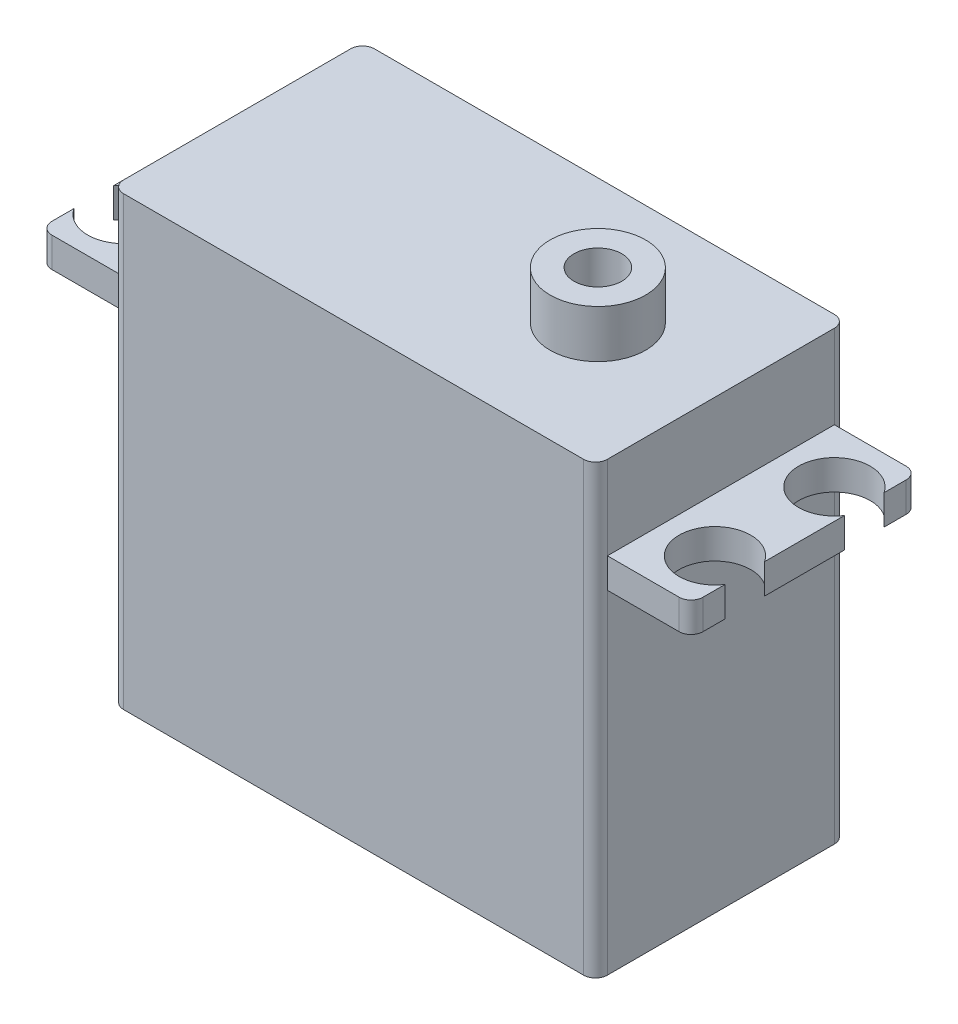
ISO-10303-21;
HEADER;
FILE_DESCRIPTION(('STEP AP214'),'2;1');
FILE_NAME('part.step','',(''),(''),'','','');
FILE_SCHEMA(('AUTOMOTIVE_DESIGN { 1 0 10303 214 1 1 1 1 }'));
ENDSEC;
DATA;
#1=APPLICATION_CONTEXT('core data for automotive mechanical design processes');
#2=APPLICATION_PROTOCOL_DEFINITION('international standard','automotive_design',2000,#1);
#3=PRODUCT_CONTEXT('',#1,'mechanical');
#4=PRODUCT('Part','Part','',(#3));
#5=PRODUCT_RELATED_PRODUCT_CATEGORY('part','',(#4));
#6=PRODUCT_DEFINITION_FORMATION('','',#4);
#7=PRODUCT_DEFINITION_CONTEXT('part definition',#1,'design');
#8=PRODUCT_DEFINITION('design','',#6,#7);
#9=PRODUCT_DEFINITION_SHAPE('','',#8);
#10=(LENGTH_UNIT() NAMED_UNIT(*) SI_UNIT(.MILLI.,.METRE.));
#11=(NAMED_UNIT(*) PLANE_ANGLE_UNIT() SI_UNIT($,.RADIAN.));
#12=(NAMED_UNIT(*) SI_UNIT($,.STERADIAN.) SOLID_ANGLE_UNIT());
#13=UNCERTAINTY_MEASURE_WITH_UNIT(LENGTH_MEASURE(1.E-05),#10,'distance_accuracy_value','');
#14=(GEOMETRIC_REPRESENTATION_CONTEXT(3) GLOBAL_UNCERTAINTY_ASSIGNED_CONTEXT((#13)) GLOBAL_UNIT_ASSIGNED_CONTEXT((#10,
#11,#12)) REPRESENTATION_CONTEXT('',''));
#15=CARTESIAN_POINT('',(0.,0.,0.));
#16=DIRECTION('',(0.,0.,1.));
#17=DIRECTION('',(1.,0.,0.));
#18=AXIS2_PLACEMENT_3D('',#15,#16,#17);
#19=CARTESIAN_POINT('',(-20.25,30.4,-10.5));
#20=DIRECTION('',(1.,0.,0.));
#21=DIRECTION('',(0.,0.,-1.));
#22=AXIS2_PLACEMENT_3D('',#19,#20,#21);
#23=PLANE('',#22);
#24=DIRECTION('',(0.,0.,1.));
#25=VECTOR('',#24,1.);
#26=CARTESIAN_POINT('',(-20.25,37.4,-10.5));
#27=LINE('',#26,#25);
#28=CARTESIAN_POINT('',(-20.25,37.4,-9.5));
#29=VERTEX_POINT('',#28);
#30=CARTESIAN_POINT('',(-20.25,37.4,9.5));
#31=VERTEX_POINT('',#30);
#32=EDGE_CURVE('E316',#29,#31,#27,.T.);
#33=ORIENTED_EDGE('',*,*,#32,.F.);
#34=DIRECTION('',(0.,-1.,0.));
#35=VECTOR('',#34,1.);
#36=CARTESIAN_POINT('',(-20.25,30.4,-9.5));
#37=LINE('',#36,#35);
#38=CARTESIAN_POINT('',(-20.25,30.4,-9.5));
#39=VERTEX_POINT('',#38);
#40=EDGE_CURVE('E462',#29,#39,#37,.T.);
#41=ORIENTED_EDGE('',*,*,#40,.T.);
#42=DIRECTION('',(0.,0.,1.));
#43=VECTOR('',#42,1.);
#44=CARTESIAN_POINT('',(-20.25,30.4,-9.5));
#45=LINE('',#44,#43);
#46=CARTESIAN_POINT('',(-20.25,30.4,9.5));
#47=VERTEX_POINT('',#46);
#48=EDGE_CURVE('E278',#39,#47,#45,.T.);
#49=ORIENTED_EDGE('',*,*,#48,.T.);
#50=DIRECTION('',(0.,-1.,0.));
#51=VECTOR('',#50,1.);
#52=CARTESIAN_POINT('',(-20.25,30.4,9.5));
#53=LINE('',#52,#51);
#54=EDGE_CURVE('E448',#47,#31,#53,.F.);
#55=ORIENTED_EDGE('',*,*,#54,.T.);
#56=EDGE_LOOP('',(#33,#41,#49,#55));
#57=FACE_BOUND('',#56,.T.);
#58=ADVANCED_FACE('F39',(#57),#23,.F.);
#59=CARTESIAN_POINT('',(20.25,30.4,10.5));
#60=DIRECTION('',(-1.,0.,0.));
#61=DIRECTION('',(0.,0.,1.));
#62=AXIS2_PLACEMENT_3D('',#59,#60,#61);
#63=PLANE('',#62);
#64=DIRECTION('',(0.,0.,-1.));
#65=VECTOR('',#64,1.);
#66=CARTESIAN_POINT('',(20.25,37.4,10.5));
#67=LINE('',#66,#65);
#68=CARTESIAN_POINT('',(20.25,37.4,9.5));
#69=VERTEX_POINT('',#68);
#70=CARTESIAN_POINT('',(20.25,37.4,-9.5));
#71=VERTEX_POINT('',#70);
#72=EDGE_CURVE('E322',#69,#71,#67,.T.);
#73=ORIENTED_EDGE('',*,*,#72,.F.);
#74=DIRECTION('',(0.,-1.,0.));
#75=VECTOR('',#74,1.);
#76=CARTESIAN_POINT('',(20.25,30.4,9.5));
#77=LINE('',#76,#75);
#78=CARTESIAN_POINT('',(20.25,30.4,9.5));
#79=VERTEX_POINT('',#78);
#80=EDGE_CURVE('E425',#69,#79,#77,.T.);
#81=ORIENTED_EDGE('',*,*,#80,.T.);
#82=DIRECTION('',(0.,0.,-1.));
#83=VECTOR('',#82,1.);
#84=CARTESIAN_POINT('',(20.25,30.4,10.5));
#85=LINE('',#84,#83);
#86=CARTESIAN_POINT('',(20.25,30.4,-9.5));
#87=VERTEX_POINT('',#86);
#88=EDGE_CURVE('E326',#79,#87,#85,.T.);
#89=ORIENTED_EDGE('',*,*,#88,.T.);
#90=DIRECTION('',(0.,-1.,0.));
#91=VECTOR('',#90,1.);
#92=CARTESIAN_POINT('',(20.25,30.4,-9.5));
#93=LINE('',#92,#91);
#94=EDGE_CURVE('E411',#87,#71,#93,.F.);
#95=ORIENTED_EDGE('',*,*,#94,.T.);
#96=EDGE_LOOP('',(#73,#81,#89,#95));
#97=FACE_BOUND('',#96,.T.);
#98=ADVANCED_FACE('F598',(#97),#63,.F.);
#99=CARTESIAN_POINT('',(-27.25,0.,0.));
#100=DIRECTION('',(-1.,0.,0.));
#101=DIRECTION('',(0.,0.,-1.));
#102=AXIS2_PLACEMENT_3D('',#99,#100,#101);
#103=PLANE('',#102);
#104=DIRECTION('',(0.,0.,1.));
#105=VECTOR('',#104,1.);
#106=CARTESIAN_POINT('',(-27.25,30.4,-9.5));
#107=LINE('',#106,#105);
#108=CARTESIAN_POINT('',(-27.25,30.4,-3.3416876048223));
#109=VERTEX_POINT('',#108);
#110=CARTESIAN_POINT('',(-27.25,30.4,3.3416876048223));
#111=VERTEX_POINT('',#110);
#112=EDGE_CURVE('E245',#109,#111,#107,.T.);
#113=ORIENTED_EDGE('',*,*,#112,.F.);
#114=DIRECTION('',(0.,1.,0.));
#115=VECTOR('',#114,1.);
#116=CARTESIAN_POINT('',(-27.25,23.4,-3.3416876048223));
#117=LINE('',#116,#115);
#118=CARTESIAN_POINT('',(-27.25,27.9,-3.3416876048223));
#119=VERTEX_POINT('',#118);
#120=EDGE_CURVE('E399',#109,#119,#117,.F.);
#121=ORIENTED_EDGE('',*,*,#120,.T.);
#122=DIRECTION('',(0.,0.,-1.));
#123=VECTOR('',#122,1.);
#124=CARTESIAN_POINT('',(-27.25,27.9,9.5));
#125=LINE('',#124,#123);
#126=CARTESIAN_POINT('',(-27.25,27.9,3.3416876048223));
#127=VERTEX_POINT('',#126);
#128=EDGE_CURVE('E258',#127,#119,#125,.T.);
#129=ORIENTED_EDGE('',*,*,#128,.F.);
#130=DIRECTION('',(0.,1.,0.));
#131=VECTOR('',#130,1.);
#132=CARTESIAN_POINT('',(-27.25,23.4,3.3416876048223));
#133=LINE('',#132,#131);
#134=EDGE_CURVE('E235',#127,#111,#133,.T.);
#135=ORIENTED_EDGE('',*,*,#134,.T.);
#136=EDGE_LOOP('',(#113,#121,#129,#135));
#137=FACE_BOUND('',#136,.T.);
#138=ADVANCED_FACE('F605',(#137),#103,.T.);
#139=CARTESIAN_POINT('',(-27.25,30.4,-8.5));
#140=VERTEX_POINT('',#139);
#141=CARTESIAN_POINT('',(-27.25,30.4,-6.6583123951777));
#142=VERTEX_POINT('',#141);
#143=EDGE_CURVE('E255',#140,#142,#107,.T.);
#144=ORIENTED_EDGE('',*,*,#143,.F.);
#145=DIRECTION('',(0.,1.,0.));
#146=VECTOR('',#145,1.);
#147=CARTESIAN_POINT('',(-27.25,0.,-8.50000000000004));
#148=LINE('',#147,#146);
#149=CARTESIAN_POINT('',(-27.25,27.9,-8.5));
#150=VERTEX_POINT('',#149);
#151=EDGE_CURVE('E481',#140,#150,#148,.F.);
#152=ORIENTED_EDGE('',*,*,#151,.T.);
#153=CARTESIAN_POINT('',(-27.25,27.9,-6.6583123951777));
#154=VERTEX_POINT('',#153);
#155=EDGE_CURVE('E260',#154,#150,#125,.T.);
#156=ORIENTED_EDGE('',*,*,#155,.F.);
#157=DIRECTION('',(0.,1.,0.));
#158=VECTOR('',#157,1.);
#159=CARTESIAN_POINT('',(-27.25,23.4,-6.6583123951777));
#160=LINE('',#159,#158);
#161=EDGE_CURVE('E234',#154,#142,#160,.T.);
#162=ORIENTED_EDGE('',*,*,#161,.T.);
#163=EDGE_LOOP('',(#144,#152,#156,#162));
#164=FACE_BOUND('',#163,.T.);
#165=ADVANCED_FACE('F753',(#164),#103,.T.);
#166=CARTESIAN_POINT('',(-27.25,27.9,8.5));
#167=VERTEX_POINT('',#166);
#168=CARTESIAN_POINT('',(-27.25,27.9,6.6583123951777));
#169=VERTEX_POINT('',#168);
#170=EDGE_CURVE('E253',#167,#169,#125,.T.);
#171=ORIENTED_EDGE('',*,*,#170,.F.);
#172=DIRECTION('',(0.,-1.,0.));
#173=VECTOR('',#172,1.);
#174=CARTESIAN_POINT('',(-27.25,0.,8.5));
#175=LINE('',#174,#173);
#176=CARTESIAN_POINT('',(-27.25,30.4,8.5));
#177=VERTEX_POINT('',#176);
#178=EDGE_CURVE('E251',#167,#177,#175,.F.);
#179=ORIENTED_EDGE('',*,*,#178,.T.);
#180=CARTESIAN_POINT('',(-27.25,30.4,6.6583123951777));
#181=VERTEX_POINT('',#180);
#182=EDGE_CURVE('E241',#181,#177,#107,.T.);
#183=ORIENTED_EDGE('',*,*,#182,.F.);
#184=DIRECTION('',(0.,1.,0.));
#185=VECTOR('',#184,1.);
#186=CARTESIAN_POINT('',(-27.25,23.4,6.6583123951777));
#187=LINE('',#186,#185);
#188=EDGE_CURVE('E223',#181,#169,#187,.F.);
#189=ORIENTED_EDGE('',*,*,#188,.T.);
#190=EDGE_LOOP('',(#171,#179,#183,#189));
#191=FACE_BOUND('',#190,.T.);
#192=ADVANCED_FACE('F249',(#191),#103,.T.);
#193=CARTESIAN_POINT('',(27.25,0.,0.));
#194=DIRECTION('',(1.,0.,0.));
#195=DIRECTION('',(0.,0.,-1.));
#196=AXIS2_PLACEMENT_3D('',#193,#194,#195);
#197=PLANE('',#196);
#198=DIRECTION('',(0.,0.,-1.));
#199=VECTOR('',#198,1.);
#200=CARTESIAN_POINT('',(27.25,27.9,9.5));
#201=LINE('',#200,#199);
#202=CARTESIAN_POINT('',(27.25,27.9,-6.6583123951777));
#203=VERTEX_POINT('',#202);
#204=CARTESIAN_POINT('',(27.25,27.9,-8.5));
#205=VERTEX_POINT('',#204);
#206=EDGE_CURVE('E335',#203,#205,#201,.T.);
#207=ORIENTED_EDGE('',*,*,#206,.T.);
#208=DIRECTION('',(0.,1.,0.));
#209=VECTOR('',#208,1.);
#210=CARTESIAN_POINT('',(27.25,30.4,-8.5));
#211=LINE('',#210,#209);
#212=CARTESIAN_POINT('',(27.25,30.4,-8.5));
#213=VERTEX_POINT('',#212);
#214=EDGE_CURVE('E512',#205,#213,#211,.T.);
#215=ORIENTED_EDGE('',*,*,#214,.T.);
#216=DIRECTION('',(0.,0.,1.));
#217=VECTOR('',#216,1.);
#218=CARTESIAN_POINT('',(27.25,30.4,-9.5));
#219=LINE('',#218,#217);
#220=CARTESIAN_POINT('',(27.25,30.4,-6.6583123951777));
#221=VERTEX_POINT('',#220);
#222=EDGE_CURVE('E332',#213,#221,#219,.T.);
#223=ORIENTED_EDGE('',*,*,#222,.T.);
#224=DIRECTION('',(0.,1.,0.));
#225=VECTOR('',#224,1.);
#226=CARTESIAN_POINT('',(27.25,23.4,-6.6583123951777));
#227=LINE('',#226,#225);
#228=EDGE_CURVE('E386',#203,#221,#227,.T.);
#229=ORIENTED_EDGE('',*,*,#228,.F.);
#230=EDGE_LOOP('',(#207,#215,#223,#229));
#231=FACE_BOUND('',#230,.T.);
#232=ADVANCED_FACE('F571',(#231),#197,.T.);
#233=DIRECTION('',(0.,1.,0.));
#234=VECTOR('',#233,1.);
#235=CARTESIAN_POINT('',(27.25,23.4,-3.3416876048223));
#236=LINE('',#235,#234);
#237=CARTESIAN_POINT('',(27.25,30.4,-3.3416876048223));
#238=VERTEX_POINT('',#237);
#239=CARTESIAN_POINT('',(27.25,27.9,-3.3416876048223));
#240=VERTEX_POINT('',#239);
#241=EDGE_CURVE('E383',#238,#240,#236,.F.);
#242=ORIENTED_EDGE('',*,*,#241,.F.);
#243=CARTESIAN_POINT('',(27.25,30.4,3.3416876048223));
#244=VERTEX_POINT('',#243);
#245=EDGE_CURVE('E336',#238,#244,#219,.T.);
#246=ORIENTED_EDGE('',*,*,#245,.T.);
#247=DIRECTION('',(0.,1.,0.));
#248=VECTOR('',#247,1.);
#249=CARTESIAN_POINT('',(27.25,23.4,3.3416876048223));
#250=LINE('',#249,#248);
#251=CARTESIAN_POINT('',(27.25,27.9,3.3416876048223));
#252=VERTEX_POINT('',#251);
#253=EDGE_CURVE('E380',#252,#244,#250,.T.);
#254=ORIENTED_EDGE('',*,*,#253,.F.);
#255=EDGE_CURVE('E342',#252,#240,#201,.T.);
#256=ORIENTED_EDGE('',*,*,#255,.T.);
#257=EDGE_LOOP('',(#242,#246,#254,#256));
#258=FACE_BOUND('',#257,.T.);
#259=ADVANCED_FACE('F580',(#258),#197,.T.);
#260=DIRECTION('',(0.,0.,-1.));
#261=VECTOR('',#260,1.);
#262=CARTESIAN_POINT('',(20.25,27.9,9.5));
#263=LINE('',#262,#261);
#264=CARTESIAN_POINT('',(20.25,27.9,9.5));
#265=VERTEX_POINT('',#264);
#266=CARTESIAN_POINT('',(20.25,27.9,-9.5));
#267=VERTEX_POINT('',#266);
#268=EDGE_CURVE('E350',#265,#267,#263,.T.);
#269=ORIENTED_EDGE('',*,*,#268,.F.);
#270=DIRECTION('',(0.,-1.,0.));
#271=VECTOR('',#270,1.);
#272=CARTESIAN_POINT('',(20.25,30.4,9.5));
#273=LINE('',#272,#271);
#274=CARTESIAN_POINT('',(20.25,0.,9.5));
#275=VERTEX_POINT('',#274);
#276=EDGE_CURVE('E422',#265,#275,#273,.T.);
#277=ORIENTED_EDGE('',*,*,#276,.T.);
#278=DIRECTION('',(0.,0.,-1.));
#279=VECTOR('',#278,1.);
#280=CARTESIAN_POINT('',(20.25,0.,10.5));
#281=LINE('',#280,#279);
#282=CARTESIAN_POINT('',(20.25,0.,-9.5));
#283=VERTEX_POINT('',#282);
#284=EDGE_CURVE('E331',#275,#283,#281,.T.);
#285=ORIENTED_EDGE('',*,*,#284,.T.);
#286=DIRECTION('',(0.,-1.,0.));
#287=VECTOR('',#286,1.);
#288=CARTESIAN_POINT('',(20.25,30.4,-9.5));
#289=LINE('',#288,#287);
#290=EDGE_CURVE('E415',#283,#267,#289,.F.);
#291=ORIENTED_EDGE('',*,*,#290,.T.);
#292=EDGE_LOOP('',(#269,#277,#285,#291));
#293=FACE_BOUND('',#292,.T.);
#294=ADVANCED_FACE('F554',(#293),#63,.F.);
#295=CARTESIAN_POINT('',(20.25,30.4,-10.5));
#296=DIRECTION('',(0.,0.,1.));
#297=DIRECTION('',(1.,0.,0.));
#298=AXIS2_PLACEMENT_3D('',#295,#296,#297);
#299=PLANE('',#298);
#300=DIRECTION('',(-1.,0.,0.));
#301=VECTOR('',#300,1.);
#302=CARTESIAN_POINT('',(20.25,0.,-10.5));
#303=LINE('',#302,#301);
#304=CARTESIAN_POINT('',(19.25,0.,-10.5));
#305=VERTEX_POINT('',#304);
#306=CARTESIAN_POINT('',(-19.25,0.,-10.5));
#307=VERTEX_POINT('',#306);
#308=EDGE_CURVE('E365',#305,#307,#303,.T.);
#309=ORIENTED_EDGE('',*,*,#308,.T.);
#310=DIRECTION('',(0.,-1.,0.));
#311=VECTOR('',#310,1.);
#312=CARTESIAN_POINT('',(-19.25,30.4,-10.5));
#313=LINE('',#312,#311);
#314=CARTESIAN_POINT('',(-19.25,37.4,-10.5));
#315=VERTEX_POINT('',#314);
#316=EDGE_CURVE('E469',#307,#315,#313,.F.);
#317=ORIENTED_EDGE('',*,*,#316,.T.);
#318=DIRECTION('',(-1.,0.,0.));
#319=VECTOR('',#318,1.);
#320=CARTESIAN_POINT('',(20.25,37.4,-10.5));
#321=LINE('',#320,#319);
#322=CARTESIAN_POINT('',(19.25,37.4,-10.5));
#323=VERTEX_POINT('',#322);
#324=EDGE_CURVE('E312',#323,#315,#321,.T.);
#325=ORIENTED_EDGE('',*,*,#324,.F.);
#326=DIRECTION('',(0.,-1.,0.));
#327=VECTOR('',#326,1.);
#328=CARTESIAN_POINT('',(19.25,30.4,-10.5));
#329=LINE('',#328,#327);
#330=EDGE_CURVE('E403',#323,#305,#329,.T.);
#331=ORIENTED_EDGE('',*,*,#330,.T.);
#332=EDGE_LOOP('',(#309,#317,#325,#331));
#333=FACE_BOUND('',#332,.T.);
#334=ADVANCED_FACE('F613',(#333),#299,.F.);
#335=DIRECTION('',(0.,0.,-1.));
#336=VECTOR('',#335,1.);
#337=CARTESIAN_POINT('',(-20.25,27.9,9.5));
#338=LINE('',#337,#336);
#339=CARTESIAN_POINT('',(-20.25,27.9,9.5));
#340=VERTEX_POINT('',#339);
#341=CARTESIAN_POINT('',(-20.25,27.9,-9.5));
#342=VERTEX_POINT('',#341);
#343=EDGE_CURVE('E623',#340,#342,#338,.T.);
#344=ORIENTED_EDGE('',*,*,#343,.T.);
#345=DIRECTION('',(0.,-1.,0.));
#346=VECTOR('',#345,1.);
#347=CARTESIAN_POINT('',(-20.25,30.4,-9.5));
#348=LINE('',#347,#346);
#349=CARTESIAN_POINT('',(-20.25,0.,-9.5));
#350=VERTEX_POINT('',#349);
#351=EDGE_CURVE('E459',#342,#350,#348,.T.);
#352=ORIENTED_EDGE('',*,*,#351,.T.);
#353=DIRECTION('',(0.,0.,1.));
#354=VECTOR('',#353,1.);
#355=CARTESIAN_POINT('',(-20.25,0.,-10.5));
#356=LINE('',#355,#354);
#357=CARTESIAN_POINT('',(-20.25,0.,9.5));
#358=VERTEX_POINT('',#357);
#359=EDGE_CURVE('E369',#350,#358,#356,.T.);
#360=ORIENTED_EDGE('',*,*,#359,.T.);
#361=DIRECTION('',(0.,-1.,0.));
#362=VECTOR('',#361,1.);
#363=CARTESIAN_POINT('',(-20.25,30.4,9.5));
#364=LINE('',#363,#362);
#365=EDGE_CURVE('E452',#358,#340,#364,.F.);
#366=ORIENTED_EDGE('',*,*,#365,.T.);
#367=EDGE_LOOP('',(#344,#352,#360,#366));
#368=FACE_BOUND('',#367,.T.);
#369=ADVANCED_FACE('F601',(#368),#23,.F.);
#370=CARTESIAN_POINT('',(-20.25,30.4,10.5));
#371=DIRECTION('',(0.,0.,-1.));
#372=DIRECTION('',(-1.,0.,0.));
#373=AXIS2_PLACEMENT_3D('',#370,#371,#372);
#374=PLANE('',#373);
#375=DIRECTION('',(1.,0.,0.));
#376=VECTOR('',#375,1.);
#377=CARTESIAN_POINT('',(-20.25,37.4,10.5));
#378=LINE('',#377,#376);
#379=CARTESIAN_POINT('',(-19.25,37.4,10.5));
#380=VERTEX_POINT('',#379);
#381=CARTESIAN_POINT('',(19.25,37.4,10.5));
#382=VERTEX_POINT('',#381);
#383=EDGE_CURVE('E319',#380,#382,#378,.T.);
#384=ORIENTED_EDGE('',*,*,#383,.F.);
#385=DIRECTION('',(0.,-1.,0.));
#386=VECTOR('',#385,1.);
#387=CARTESIAN_POINT('',(-19.25,30.4,10.5));
#388=LINE('',#387,#386);
#389=CARTESIAN_POINT('',(-19.25,0.,10.5));
#390=VERTEX_POINT('',#389);
#391=EDGE_CURVE('E440',#380,#390,#388,.T.);
#392=ORIENTED_EDGE('',*,*,#391,.T.);
#393=DIRECTION('',(1.,0.,0.));
#394=VECTOR('',#393,1.);
#395=CARTESIAN_POINT('',(-20.25,0.,10.5));
#396=LINE('',#395,#394);
#397=CARTESIAN_POINT('',(19.25,0.,10.5));
#398=VERTEX_POINT('',#397);
#399=EDGE_CURVE('E372',#390,#398,#396,.T.);
#400=ORIENTED_EDGE('',*,*,#399,.T.);
#401=DIRECTION('',(0.,-1.,0.));
#402=VECTOR('',#401,1.);
#403=CARTESIAN_POINT('',(19.25,30.4,10.5));
#404=LINE('',#403,#402);
#405=EDGE_CURVE('E433',#398,#382,#404,.F.);
#406=ORIENTED_EDGE('',*,*,#405,.T.);
#407=EDGE_LOOP('',(#384,#392,#400,#406));
#408=FACE_BOUND('',#407,.T.);
#409=ADVANCED_FACE('F612',(#408),#374,.F.);
#410=CARTESIAN_POINT('',(0.,30.4,0.));
#411=DIRECTION('',(0.,1.,0.));
#412=DIRECTION('',(0.,0.,1.));
#413=AXIS2_PLACEMENT_3D('',#410,#411,#412);
#414=PLANE('',#413);
#415=ORIENTED_EDGE('',*,*,#222,.F.);
#416=CARTESIAN_POINT('',(26.25,30.4,-8.5));
#417=DIRECTION('',(0.,1.,0.));
#418=DIRECTION('',(0.,0.,1.));
#419=AXIS2_PLACEMENT_3D('',#416,#417,#418);
#420=CIRCLE('',#419,1.);
#421=CARTESIAN_POINT('',(26.25,30.4,-9.5));
#422=VERTEX_POINT('',#421);
#423=EDGE_CURVE('E62',#213,#422,#420,.T.);
#424=ORIENTED_EDGE('',*,*,#423,.T.);
#425=DIRECTION('',(-1.,0.,0.));
#426=VECTOR('',#425,1.);
#427=CARTESIAN_POINT('',(27.25,30.4,-9.5));
#428=LINE('',#427,#426);
#429=EDGE_CURVE('E362',#422,#87,#428,.T.);
#430=ORIENTED_EDGE('',*,*,#429,.T.);
#431=ORIENTED_EDGE('',*,*,#88,.F.);
#432=DIRECTION('',(-1.,0.,0.));
#433=VECTOR('',#432,1.);
#434=CARTESIAN_POINT('',(27.25,30.4,9.5));
#435=LINE('',#434,#433);
#436=CARTESIAN_POINT('',(26.25,30.4,9.5));
#437=VERTEX_POINT('',#436);
#438=EDGE_CURVE('E359',#437,#79,#435,.T.);
#439=ORIENTED_EDGE('',*,*,#438,.F.);
#440=CARTESIAN_POINT('',(26.25,30.4,8.5));
#441=DIRECTION('',(0.,1.,0.));
#442=DIRECTION('',(0.,0.,1.));
#443=AXIS2_PLACEMENT_3D('',#440,#441,#442);
#444=CIRCLE('',#443,1.);
#445=CARTESIAN_POINT('',(27.25,30.4,8.5));
#446=VERTEX_POINT('',#445);
#447=EDGE_CURVE('E509',#437,#446,#444,.T.);
#448=ORIENTED_EDGE('',*,*,#447,.T.);
#449=CARTESIAN_POINT('',(27.25,30.4,6.6583123951777));
#450=VERTEX_POINT('',#449);
#451=EDGE_CURVE('E337',#450,#446,#219,.T.);
#452=ORIENTED_EDGE('',*,*,#451,.F.);
#453=CARTESIAN_POINT('',(24.75,30.4,5.));
#454=DIRECTION('',(0.,1.,0.));
#455=DIRECTION('',(0.,0.,-1.));
#456=AXIS2_PLACEMENT_3D('',#453,#454,#455);
#457=CIRCLE('',#456,3.);
#458=EDGE_CURVE('E295',#244,#450,#457,.T.);
#459=ORIENTED_EDGE('',*,*,#458,.F.);
#460=ORIENTED_EDGE('',*,*,#245,.F.);
#461=CARTESIAN_POINT('',(24.75,30.4,-5.));
#462=DIRECTION('',(0.,1.,0.));
#463=DIRECTION('',(0.,0.,1.));
#464=AXIS2_PLACEMENT_3D('',#461,#462,#463);
#465=CIRCLE('',#464,3.);
#466=EDGE_CURVE('E299',#221,#238,#465,.T.);
#467=ORIENTED_EDGE('',*,*,#466,.F.);
#468=EDGE_LOOP('',(#415,#424,#430,#431,#439,#448,#452,#459,#460,#467));
#469=FACE_BOUND('',#468,.T.);
#470=ADVANCED_FACE('F574',(#469),#414,.T.);
#471=CARTESIAN_POINT('',(0.,0.,0.));
#472=DIRECTION('',(0.,1.,0.));
#473=DIRECTION('',(0.,0.,1.));
#474=AXIS2_PLACEMENT_3D('',#471,#472,#473);
#475=PLANE('',#474);
#476=ORIENTED_EDGE('',*,*,#359,.F.);
#477=CARTESIAN_POINT('',(-19.25,0.,-9.5));
#478=DIRECTION('',(0.,1.,0.));
#479=DIRECTION('',(0.,0.,1.));
#480=AXIS2_PLACEMENT_3D('',#477,#478,#479);
#481=CIRCLE('',#480,1.);
#482=EDGE_CURVE('E466',#350,#307,#481,.F.);
#483=ORIENTED_EDGE('',*,*,#482,.T.);
#484=ORIENTED_EDGE('',*,*,#308,.F.);
#485=CARTESIAN_POINT('',(19.25,0.,-9.5));
#486=DIRECTION('',(0.,1.,0.));
#487=DIRECTION('',(0.,0.,1.));
#488=AXIS2_PLACEMENT_3D('',#485,#486,#487);
#489=CIRCLE('',#488,1.);
#490=EDGE_CURVE('E407',#305,#283,#489,.F.);
#491=ORIENTED_EDGE('',*,*,#490,.T.);
#492=ORIENTED_EDGE('',*,*,#284,.F.);
#493=CARTESIAN_POINT('',(19.25,0.,9.5));
#494=DIRECTION('',(0.,1.,0.));
#495=DIRECTION('',(0.,0.,1.));
#496=AXIS2_PLACEMENT_3D('',#493,#494,#495);
#497=CIRCLE('',#496,1.);
#498=EDGE_CURVE('E429',#275,#398,#497,.F.);
#499=ORIENTED_EDGE('',*,*,#498,.T.);
#500=ORIENTED_EDGE('',*,*,#399,.F.);
#501=CARTESIAN_POINT('',(-19.25,0.,9.5));
#502=DIRECTION('',(0.,1.,0.));
#503=DIRECTION('',(0.,0.,1.));
#504=AXIS2_PLACEMENT_3D('',#501,#502,#503);
#505=CIRCLE('',#504,1.);
#506=EDGE_CURVE('E444',#390,#358,#505,.F.);
#507=ORIENTED_EDGE('',*,*,#506,.T.);
#508=EDGE_LOOP('',(#476,#483,#484,#491,#492,#499,#500,#507));
#509=FACE_BOUND('',#508,.T.);
#510=ADVANCED_FACE('F557',(#509),#475,.F.);
#511=CARTESIAN_POINT('',(27.25,27.9,-9.5));
#512=DIRECTION('',(0.,0.,1.));
#513=DIRECTION('',(0.,-1.,0.));
#514=AXIS2_PLACEMENT_3D('',#511,#512,#513);
#515=PLANE('',#514);
#516=ORIENTED_EDGE('',*,*,#429,.F.);
#517=DIRECTION('',(0.,1.,0.));
#518=VECTOR('',#517,1.);
#519=CARTESIAN_POINT('',(26.25,27.9,-9.5));
#520=LINE('',#519,#518);
#521=CARTESIAN_POINT('',(26.25,27.9,-9.5));
#522=VERTEX_POINT('',#521);
#523=EDGE_CURVE('E48',#422,#522,#520,.F.);
#524=ORIENTED_EDGE('',*,*,#523,.T.);
#525=DIRECTION('',(-1.,0.,0.));
#526=VECTOR('',#525,1.);
#527=CARTESIAN_POINT('',(27.25,27.9,-9.5));
#528=LINE('',#527,#526);
#529=EDGE_CURVE('E341',#522,#267,#528,.T.);
#530=ORIENTED_EDGE('',*,*,#529,.T.);
#531=DIRECTION('',(0.,1.,0.));
#532=VECTOR('',#531,1.);
#533=CARTESIAN_POINT('',(20.25,27.9,-9.5));
#534=LINE('',#533,#532);
#535=EDGE_CURVE('E325',#267,#87,#534,.T.);
#536=ORIENTED_EDGE('',*,*,#535,.T.);
#537=EDGE_LOOP('',(#516,#524,#530,#536));
#538=FACE_BOUND('',#537,.T.);
#539=ADVANCED_FACE('F644',(#538),#515,.F.);
#540=CARTESIAN_POINT('',(27.25,30.4,9.5));
#541=DIRECTION('',(0.,0.,-1.));
#542=DIRECTION('',(-1.,0.,0.));
#543=AXIS2_PLACEMENT_3D('',#540,#541,#542);
#544=PLANE('',#543);
#545=DIRECTION('',(-1.,0.,0.));
#546=VECTOR('',#545,1.);
#547=CARTESIAN_POINT('',(27.25,27.9,9.5));
#548=LINE('',#547,#546);
#549=CARTESIAN_POINT('',(26.25,27.9,9.5));
#550=VERTEX_POINT('',#549);
#551=EDGE_CURVE('E356',#550,#265,#548,.T.);
#552=ORIENTED_EDGE('',*,*,#551,.F.);
#553=DIRECTION('',(0.,-1.,0.));
#554=VECTOR('',#553,1.);
#555=CARTESIAN_POINT('',(26.25,30.4,9.5));
#556=LINE('',#555,#554);
#557=EDGE_CURVE('E506',#550,#437,#556,.F.);
#558=ORIENTED_EDGE('',*,*,#557,.T.);
#559=ORIENTED_EDGE('',*,*,#438,.T.);
#560=DIRECTION('',(0.,-1.,0.));
#561=VECTOR('',#560,1.);
#562=CARTESIAN_POINT('',(20.25,30.4,9.5));
#563=LINE('',#562,#561);
#564=EDGE_CURVE('E346',#79,#265,#563,.T.);
#565=ORIENTED_EDGE('',*,*,#564,.T.);
#566=EDGE_LOOP('',(#552,#558,#559,#565));
#567=FACE_BOUND('',#566,.T.);
#568=ADVANCED_FACE('F542',(#567),#544,.F.);
#569=CARTESIAN_POINT('',(27.25,27.9,9.5));
#570=DIRECTION('',(0.,1.,0.));
#571=DIRECTION('',(0.,0.,1.));
#572=AXIS2_PLACEMENT_3D('',#569,#570,#571);
#573=PLANE('',#572);
#574=ORIENTED_EDGE('',*,*,#529,.F.);
#575=CARTESIAN_POINT('',(26.25,27.9,-8.5));
#576=DIRECTION('',(0.,1.,0.));
#577=DIRECTION('',(0.,0.,1.));
#578=AXIS2_PLACEMENT_3D('',#575,#576,#577);
#579=CIRCLE('',#578,1.);
#580=EDGE_CURVE('E11',#522,#205,#579,.F.);
#581=ORIENTED_EDGE('',*,*,#580,.T.);
#582=ORIENTED_EDGE('',*,*,#206,.F.);
#583=CARTESIAN_POINT('',(24.75,27.9,-5.));
#584=DIRECTION('',(0.,1.,0.));
#585=DIRECTION('',(0.,0.,1.));
#586=AXIS2_PLACEMENT_3D('',#583,#584,#585);
#587=CIRCLE('',#586,3.);
#588=EDGE_CURVE('E308',#203,#240,#587,.T.);
#589=ORIENTED_EDGE('',*,*,#588,.T.);
#590=ORIENTED_EDGE('',*,*,#255,.F.);
#591=CARTESIAN_POINT('',(24.75,27.9,5.));
#592=DIRECTION('',(0.,1.,0.));
#593=DIRECTION('',(0.,0.,1.));
#594=AXIS2_PLACEMENT_3D('',#591,#592,#593);
#595=CIRCLE('',#594,3.);
#596=CARTESIAN_POINT('',(27.25,27.9,6.6583123951777));
#597=VERTEX_POINT('',#596);
#598=EDGE_CURVE('E302',#252,#597,#595,.T.);
#599=ORIENTED_EDGE('',*,*,#598,.T.);
#600=CARTESIAN_POINT('',(27.25,27.9,8.5));
#601=VERTEX_POINT('',#600);
#602=EDGE_CURVE('E338',#601,#597,#201,.T.);
#603=ORIENTED_EDGE('',*,*,#602,.F.);
#604=CARTESIAN_POINT('',(26.25,27.9,8.5));
#605=DIRECTION('',(0.,1.,0.));
#606=DIRECTION('',(0.,0.,1.));
#607=AXIS2_PLACEMENT_3D('',#604,#605,#606);
#608=CIRCLE('',#607,1.);
#609=EDGE_CURVE('E503',#601,#550,#608,.F.);
#610=ORIENTED_EDGE('',*,*,#609,.T.);
#611=ORIENTED_EDGE('',*,*,#551,.T.);
#612=ORIENTED_EDGE('',*,*,#268,.T.);
#613=EDGE_LOOP('',(#574,#581,#582,#589,#590,#599,#603,#610,#611,#612));
#614=FACE_BOUND('',#613,.T.);
#615=ADVANCED_FACE('F539',(#614),#573,.F.);
#616=ORIENTED_EDGE('',*,*,#451,.T.);
#617=DIRECTION('',(0.,-1.,0.));
#618=VECTOR('',#617,1.);
#619=CARTESIAN_POINT('',(27.25,27.9,8.5));
#620=LINE('',#619,#618);
#621=EDGE_CURVE('E499',#446,#601,#620,.T.);
#622=ORIENTED_EDGE('',*,*,#621,.T.);
#623=ORIENTED_EDGE('',*,*,#602,.T.);
#624=DIRECTION('',(0.,1.,0.));
#625=VECTOR('',#624,1.);
#626=CARTESIAN_POINT('',(27.25,23.4,6.6583123951777));
#627=LINE('',#626,#625);
#628=EDGE_CURVE('E330',#450,#597,#627,.F.);
#629=ORIENTED_EDGE('',*,*,#628,.F.);
#630=EDGE_LOOP('',(#616,#622,#623,#629));
#631=FACE_BOUND('',#630,.T.);
#632=ADVANCED_FACE('F530',(#631),#197,.T.);
#633=CARTESIAN_POINT('',(0.,37.4,0.));
#634=DIRECTION('',(0.,1.,0.));
#635=DIRECTION('',(0.,0.,1.));
#636=AXIS2_PLACEMENT_3D('',#633,#634,#635);
#637=PLANE('',#636);
#638=CARTESIAN_POINT('',(9.95,37.4,0.));
#639=DIRECTION('',(0.,1.,0.));
#640=DIRECTION('',(0.,0.,1.));
#641=AXIS2_PLACEMENT_3D('',#638,#639,#640);
#642=CIRCLE('',#641,4.);
#643=CARTESIAN_POINT('',(9.95,37.4,4.));
#644=VERTEX_POINT('',#643);
#645=EDGE_CURVE('E290',#644,#644,#642,.T.);
#646=ORIENTED_EDGE('',*,*,#645,.F.);
#647=EDGE_LOOP('',(#646));
#648=FACE_BOUND('',#647,.T.);
#649=ORIENTED_EDGE('',*,*,#324,.T.);
#650=CARTESIAN_POINT('',(-19.25,37.4,-9.5));
#651=DIRECTION('',(0.,1.,0.));
#652=DIRECTION('',(0.,0.,1.));
#653=AXIS2_PLACEMENT_3D('',#650,#651,#652);
#654=CIRCLE('',#653,1.);
#655=EDGE_CURVE('E472',#315,#29,#654,.T.);
#656=ORIENTED_EDGE('',*,*,#655,.T.);
#657=ORIENTED_EDGE('',*,*,#32,.T.);
#658=CARTESIAN_POINT('',(-19.25,37.4,9.5));
#659=DIRECTION('',(0.,1.,0.));
#660=DIRECTION('',(0.,0.,1.));
#661=AXIS2_PLACEMENT_3D('',#658,#659,#660);
#662=CIRCLE('',#661,1.);
#663=EDGE_CURVE('E456',#31,#380,#662,.T.);
#664=ORIENTED_EDGE('',*,*,#663,.T.);
#665=ORIENTED_EDGE('',*,*,#383,.T.);
#666=CARTESIAN_POINT('',(19.25,37.4,9.5));
#667=DIRECTION('',(0.,1.,0.));
#668=DIRECTION('',(0.,0.,1.));
#669=AXIS2_PLACEMENT_3D('',#666,#667,#668);
#670=CIRCLE('',#669,1.);
#671=EDGE_CURVE('E437',#382,#69,#670,.T.);
#672=ORIENTED_EDGE('',*,*,#671,.T.);
#673=ORIENTED_EDGE('',*,*,#72,.T.);
#674=CARTESIAN_POINT('',(19.25,37.4,-9.5));
#675=DIRECTION('',(0.,1.,0.));
#676=DIRECTION('',(0.,0.,1.));
#677=AXIS2_PLACEMENT_3D('',#674,#675,#676);
#678=CIRCLE('',#677,1.);
#679=EDGE_CURVE('E419',#71,#323,#678,.T.);
#680=ORIENTED_EDGE('',*,*,#679,.T.);
#681=EDGE_LOOP('',(#649,#656,#657,#664,#665,#672,#673,#680));
#682=FACE_BOUND('',#681,.T.);
#683=ADVANCED_FACE('F586',(#648,#682),#637,.T.);
#684=CARTESIAN_POINT('',(24.75,23.4,5.));
#685=DIRECTION('',(0.,1.,0.));
#686=DIRECTION('',(0.,0.,1.));
#687=AXIS2_PLACEMENT_3D('',#684,#685,#686);
#688=CYLINDRICAL_SURFACE('',#687,3.);
#689=ORIENTED_EDGE('',*,*,#253,.T.);
#690=ORIENTED_EDGE('',*,*,#458,.T.);
#691=ORIENTED_EDGE('',*,*,#628,.T.);
#692=ORIENTED_EDGE('',*,*,#598,.F.);
#693=EDGE_LOOP('',(#689,#690,#691,#692));
#694=FACE_BOUND('',#693,.T.);
#695=ADVANCED_FACE('F584',(#694),#688,.F.);
#696=CARTESIAN_POINT('',(24.75,23.4,-5.));
#697=DIRECTION('',(0.,1.,0.));
#698=DIRECTION('',(0.,0.,1.));
#699=AXIS2_PLACEMENT_3D('',#696,#697,#698);
#700=CYLINDRICAL_SURFACE('',#699,3.);
#701=ORIENTED_EDGE('',*,*,#228,.T.);
#702=ORIENTED_EDGE('',*,*,#466,.T.);
#703=ORIENTED_EDGE('',*,*,#241,.T.);
#704=ORIENTED_EDGE('',*,*,#588,.F.);
#705=EDGE_LOOP('',(#701,#702,#703,#704));
#706=FACE_BOUND('',#705,.T.);
#707=ADVANCED_FACE('F578',(#706),#700,.F.);
#708=CARTESIAN_POINT('',(9.95,41.4,0.));
#709=DIRECTION('',(0.,1.,0.));
#710=DIRECTION('',(0.,0.,1.));
#711=AXIS2_PLACEMENT_3D('',#708,#709,#710);
#712=PLANE('',#711);
#713=CARTESIAN_POINT('',(9.95,41.4,0.));
#714=DIRECTION('',(0.,1.,0.));
#715=DIRECTION('',(0.,0.,1.));
#716=AXIS2_PLACEMENT_3D('',#713,#714,#715);
#717=CIRCLE('',#716,4.);
#718=CARTESIAN_POINT('',(9.95,41.4,4.));
#719=VERTEX_POINT('',#718);
#720=EDGE_CURVE('E291',#719,#719,#717,.T.);
#721=ORIENTED_EDGE('',*,*,#720,.T.);
#722=EDGE_LOOP('',(#721));
#723=FACE_BOUND('',#722,.T.);
#724=CARTESIAN_POINT('',(9.95,41.4,0.));
#725=DIRECTION('',(0.,1.,0.));
#726=DIRECTION('',(0.,0.,1.));
#727=AXIS2_PLACEMENT_3D('',#724,#725,#726);
#728=CIRCLE('',#727,2.);
#729=CARTESIAN_POINT('',(9.95,41.4,2.));
#730=VERTEX_POINT('',#729);
#731=EDGE_CURVE('E286',#730,#730,#728,.T.);
#732=ORIENTED_EDGE('',*,*,#731,.F.);
#733=EDGE_LOOP('',(#732));
#734=FACE_BOUND('',#733,.T.);
#735=ADVANCED_FACE('F592',(#723,#734),#712,.T.);
#736=CARTESIAN_POINT('',(9.95,41.4,0.));
#737=DIRECTION('',(0.,-1.,0.));
#738=DIRECTION('',(0.,0.,-1.));
#739=AXIS2_PLACEMENT_3D('',#736,#737,#738);
#740=CYLINDRICAL_SURFACE('',#739,4.);
#741=ORIENTED_EDGE('',*,*,#720,.F.);
#742=EDGE_LOOP('',(#741));
#743=FACE_BOUND('',#742,.T.);
#744=ORIENTED_EDGE('',*,*,#645,.T.);
#745=EDGE_LOOP('',(#744));
#746=FACE_BOUND('',#745,.T.);
#747=ADVANCED_FACE('F905',(#743,#746),#740,.T.);
#748=CARTESIAN_POINT('',(9.95,41.4,0.));
#749=DIRECTION('',(0.,-1.,0.));
#750=DIRECTION('',(0.,0.,-1.));
#751=AXIS2_PLACEMENT_3D('',#748,#749,#750);
#752=CYLINDRICAL_SURFACE('',#751,2.);
#753=ORIENTED_EDGE('',*,*,#731,.T.);
#754=EDGE_LOOP('',(#753));
#755=FACE_BOUND('',#754,.T.);
#756=CARTESIAN_POINT('',(9.95,37.4,0.));
#757=DIRECTION('',(0.,1.,0.));
#758=DIRECTION('',(0.,0.,1.));
#759=AXIS2_PLACEMENT_3D('',#756,#757,#758);
#760=CIRCLE('',#759,2.);
#761=CARTESIAN_POINT('',(9.95,37.4,2.));
#762=VERTEX_POINT('',#761);
#763=EDGE_CURVE('E390',#762,#762,#760,.F.);
#764=ORIENTED_EDGE('',*,*,#763,.T.);
#765=EDGE_LOOP('',(#764));
#766=FACE_BOUND('',#765,.T.);
#767=ADVANCED_FACE('F895',(#755,#766),#752,.F.);
#768=ORIENTED_EDGE('',*,*,#763,.F.);
#769=EDGE_LOOP('',(#768));
#770=FACE_BOUND('',#769,.T.);
#771=ADVANCED_FACE('F596',(#770),#637,.T.);
#772=CARTESIAN_POINT('',(-27.25,27.9,-9.5));
#773=DIRECTION('',(0.,0.,-1.));
#774=DIRECTION('',(0.,1.,0.));
#775=AXIS2_PLACEMENT_3D('',#772,#773,#774);
#776=PLANE('',#775);
#777=DIRECTION('',(1.,0.,0.));
#778=VECTOR('',#777,1.);
#779=CARTESIAN_POINT('',(-27.25,27.9,-9.5));
#780=LINE('',#779,#778);
#781=CARTESIAN_POINT('',(-26.25,27.9,-9.5));
#782=VERTEX_POINT('',#781);
#783=EDGE_CURVE('E283',#782,#342,#780,.T.);
#784=ORIENTED_EDGE('',*,*,#783,.F.);
#785=DIRECTION('',(0.,1.,0.));
#786=VECTOR('',#785,1.);
#787=CARTESIAN_POINT('',(-26.25,27.9,-9.5));
#788=LINE('',#787,#786);
#789=CARTESIAN_POINT('',(-26.25,30.4,-9.5));
#790=VERTEX_POINT('',#789);
#791=EDGE_CURVE('E475',#782,#790,#788,.T.);
#792=ORIENTED_EDGE('',*,*,#791,.T.);
#793=DIRECTION('',(1.,0.,0.));
#794=VECTOR('',#793,1.);
#795=CARTESIAN_POINT('',(-27.25,30.4,-9.5));
#796=LINE('',#795,#794);
#797=EDGE_CURVE('E263',#790,#39,#796,.T.);
#798=ORIENTED_EDGE('',*,*,#797,.T.);
#799=DIRECTION('',(0.,1.,0.));
#800=VECTOR('',#799,1.);
#801=CARTESIAN_POINT('',(-20.25,27.9,-9.5));
#802=LINE('',#801,#800);
#803=EDGE_CURVE('E631',#342,#39,#802,.T.);
#804=ORIENTED_EDGE('',*,*,#803,.F.);
#805=EDGE_LOOP('',(#784,#792,#798,#804));
#806=FACE_BOUND('',#805,.T.);
#807=ADVANCED_FACE('F766',(#806),#776,.T.);
#808=CARTESIAN_POINT('',(-27.25,27.9,9.5));
#809=DIRECTION('',(0.,-1.,0.));
#810=DIRECTION('',(0.,0.,-1.));
#811=AXIS2_PLACEMENT_3D('',#808,#809,#810);
#812=PLANE('',#811);
#813=DIRECTION('',(1.,0.,0.));
#814=VECTOR('',#813,1.);
#815=CARTESIAN_POINT('',(-27.25,27.9,9.5));
#816=LINE('',#815,#814);
#817=CARTESIAN_POINT('',(-26.25,27.9,9.5));
#818=VERTEX_POINT('',#817);
#819=EDGE_CURVE('E275',#818,#340,#816,.T.);
#820=ORIENTED_EDGE('',*,*,#819,.F.);
#821=CARTESIAN_POINT('',(-26.25,27.9,8.5));
#822=DIRECTION('',(0.,-1.,0.));
#823=DIRECTION('',(0.,0.,-1.));
#824=AXIS2_PLACEMENT_3D('',#821,#822,#823);
#825=CIRCLE('',#824,1.);
#826=EDGE_CURVE('E491',#818,#167,#825,.T.);
#827=ORIENTED_EDGE('',*,*,#826,.T.);
#828=ORIENTED_EDGE('',*,*,#170,.T.);
#829=CARTESIAN_POINT('',(-24.75,27.9,5.));
#830=DIRECTION('',(0.,-1.,0.));
#831=DIRECTION('',(0.,0.,-1.));
#832=AXIS2_PLACEMENT_3D('',#829,#830,#831);
#833=CIRCLE('',#832,3.);
#834=EDGE_CURVE('E229',#169,#127,#833,.F.);
#835=ORIENTED_EDGE('',*,*,#834,.T.);
#836=ORIENTED_EDGE('',*,*,#128,.T.);
#837=CARTESIAN_POINT('',(-24.75,27.9,-5.));
#838=DIRECTION('',(0.,-1.,0.));
#839=DIRECTION('',(0.,0.,-1.));
#840=AXIS2_PLACEMENT_3D('',#837,#838,#839);
#841=CIRCLE('',#840,3.);
#842=EDGE_CURVE('E957',#119,#154,#841,.F.);
#843=ORIENTED_EDGE('',*,*,#842,.T.);
#844=ORIENTED_EDGE('',*,*,#155,.T.);
#845=CARTESIAN_POINT('',(-26.25,27.9,-8.5));
#846=DIRECTION('',(0.,-1.,0.));
#847=DIRECTION('',(0.,0.,-1.));
#848=AXIS2_PLACEMENT_3D('',#845,#846,#847);
#849=CIRCLE('',#848,1.);
#850=EDGE_CURVE('E484',#150,#782,#849,.T.);
#851=ORIENTED_EDGE('',*,*,#850,.T.);
#852=ORIENTED_EDGE('',*,*,#783,.T.);
#853=ORIENTED_EDGE('',*,*,#343,.F.);
#854=EDGE_LOOP('',(#820,#827,#828,#835,#836,#843,#844,#851,#852,#853));
#855=FACE_BOUND('',#854,.T.);
#856=ADVANCED_FACE('F771',(#855),#812,.T.);
#857=CARTESIAN_POINT('',(-27.25,30.4,9.5));
#858=DIRECTION('',(0.,0.,1.));
#859=DIRECTION('',(1.,0.,0.));
#860=AXIS2_PLACEMENT_3D('',#857,#858,#859);
#861=PLANE('',#860);
#862=DIRECTION('',(1.,0.,0.));
#863=VECTOR('',#862,1.);
#864=CARTESIAN_POINT('',(-27.25,30.4,9.5));
#865=LINE('',#864,#863);
#866=CARTESIAN_POINT('',(-26.25,30.4,9.5));
#867=VERTEX_POINT('',#866);
#868=EDGE_CURVE('E267',#867,#47,#865,.T.);
#869=ORIENTED_EDGE('',*,*,#868,.F.);
#870=DIRECTION('',(0.,-1.,0.));
#871=VECTOR('',#870,1.);
#872=CARTESIAN_POINT('',(-26.25,30.4,9.5));
#873=LINE('',#872,#871);
#874=EDGE_CURVE('E487',#867,#818,#873,.T.);
#875=ORIENTED_EDGE('',*,*,#874,.T.);
#876=ORIENTED_EDGE('',*,*,#819,.T.);
#877=DIRECTION('',(0.,-1.,0.));
#878=VECTOR('',#877,1.);
#879=CARTESIAN_POINT('',(-20.25,30.4,9.5));
#880=LINE('',#879,#878);
#881=EDGE_CURVE('E630',#47,#340,#880,.T.);
#882=ORIENTED_EDGE('',*,*,#881,.F.);
#883=EDGE_LOOP('',(#869,#875,#876,#882));
#884=FACE_BOUND('',#883,.T.);
#885=ADVANCED_FACE('F795',(#884),#861,.T.);
#886=CARTESIAN_POINT('',(-27.25,30.4,-9.5));
#887=DIRECTION('',(0.,1.,0.));
#888=DIRECTION('',(0.,0.,1.));
#889=AXIS2_PLACEMENT_3D('',#886,#887,#888);
#890=PLANE('',#889);
#891=ORIENTED_EDGE('',*,*,#182,.T.);
#892=CARTESIAN_POINT('',(-26.25,30.4,8.5));
#893=DIRECTION('',(0.,1.,0.));
#894=DIRECTION('',(0.,0.,1.));
#895=AXIS2_PLACEMENT_3D('',#892,#893,#894);
#896=CIRCLE('',#895,1.);
#897=EDGE_CURVE('E496',#177,#867,#896,.T.);
#898=ORIENTED_EDGE('',*,*,#897,.T.);
#899=ORIENTED_EDGE('',*,*,#868,.T.);
#900=ORIENTED_EDGE('',*,*,#48,.F.);
#901=ORIENTED_EDGE('',*,*,#797,.F.);
#902=CARTESIAN_POINT('',(-26.25,30.4,-8.5));
#903=DIRECTION('',(0.,1.,0.));
#904=DIRECTION('',(0.,0.,1.));
#905=AXIS2_PLACEMENT_3D('',#902,#903,#904);
#906=CIRCLE('',#905,1.);
#907=EDGE_CURVE('E478',#790,#140,#906,.T.);
#908=ORIENTED_EDGE('',*,*,#907,.T.);
#909=ORIENTED_EDGE('',*,*,#143,.T.);
#910=CARTESIAN_POINT('',(-24.75,30.4,-5.));
#911=DIRECTION('',(0.,-1.,0.));
#912=DIRECTION('',(0.,0.,1.));
#913=AXIS2_PLACEMENT_3D('',#910,#911,#912);
#914=CIRCLE('',#913,3.);
#915=EDGE_CURVE('E247',#142,#109,#914,.T.);
#916=ORIENTED_EDGE('',*,*,#915,.T.);
#917=ORIENTED_EDGE('',*,*,#112,.T.);
#918=CARTESIAN_POINT('',(-24.75,30.4,5.));
#919=DIRECTION('',(0.,-1.,0.));
#920=DIRECTION('',(0.,0.,-1.));
#921=AXIS2_PLACEMENT_3D('',#918,#919,#920);
#922=CIRCLE('',#921,3.);
#923=EDGE_CURVE('E226',#111,#181,#922,.T.);
#924=ORIENTED_EDGE('',*,*,#923,.T.);
#925=EDGE_LOOP('',(#891,#898,#899,#900,#901,#908,#909,#916,#917,#924));
#926=FACE_BOUND('',#925,.T.);
#927=ADVANCED_FACE('F240',(#926),#890,.T.);
#928=CARTESIAN_POINT('',(-24.75,23.4,5.));
#929=DIRECTION('',(0.,1.,0.));
#930=DIRECTION('',(0.,0.,1.));
#931=AXIS2_PLACEMENT_3D('',#928,#929,#930);
#932=CYLINDRICAL_SURFACE('',#931,3.);
#933=ORIENTED_EDGE('',*,*,#923,.F.);
#934=ORIENTED_EDGE('',*,*,#134,.F.);
#935=ORIENTED_EDGE('',*,*,#834,.F.);
#936=ORIENTED_EDGE('',*,*,#188,.F.);
#937=EDGE_LOOP('',(#933,#934,#935,#936));
#938=FACE_BOUND('',#937,.T.);
#939=ADVANCED_FACE('F225',(#938),#932,.F.);
#940=CARTESIAN_POINT('',(-24.75,23.4,-5.));
#941=DIRECTION('',(0.,1.,0.));
#942=DIRECTION('',(0.,0.,1.));
#943=AXIS2_PLACEMENT_3D('',#940,#941,#942);
#944=CYLINDRICAL_SURFACE('',#943,3.);
#945=ORIENTED_EDGE('',*,*,#915,.F.);
#946=ORIENTED_EDGE('',*,*,#161,.F.);
#947=ORIENTED_EDGE('',*,*,#842,.F.);
#948=ORIENTED_EDGE('',*,*,#120,.F.);
#949=EDGE_LOOP('',(#945,#946,#947,#948));
#950=FACE_BOUND('',#949,.T.);
#951=ADVANCED_FACE('F818',(#950),#944,.F.);
#952=CARTESIAN_POINT('',(19.25,30.4,-9.5));
#953=DIRECTION('',(0.,-1.,0.));
#954=DIRECTION('',(0.,0.,-1.));
#955=AXIS2_PLACEMENT_3D('',#952,#953,#954);
#956=CYLINDRICAL_SURFACE('',#955,1.);
#957=ORIENTED_EDGE('',*,*,#535,.F.);
#958=ORIENTED_EDGE('',*,*,#290,.F.);
#959=ORIENTED_EDGE('',*,*,#490,.F.);
#960=ORIENTED_EDGE('',*,*,#330,.F.);
#961=ORIENTED_EDGE('',*,*,#679,.F.);
#962=ORIENTED_EDGE('',*,*,#94,.F.);
#963=EDGE_LOOP('',(#957,#958,#959,#960,#961,#962));
#964=FACE_BOUND('',#963,.T.);
#965=ADVANCED_FACE('F564',(#964),#956,.T.);
#966=CARTESIAN_POINT('',(19.25,30.4,9.5));
#967=DIRECTION('',(0.,-1.,0.));
#968=DIRECTION('',(0.,0.,-1.));
#969=AXIS2_PLACEMENT_3D('',#966,#967,#968);
#970=CYLINDRICAL_SURFACE('',#969,1.);
#971=ORIENTED_EDGE('',*,*,#671,.F.);
#972=ORIENTED_EDGE('',*,*,#405,.F.);
#973=ORIENTED_EDGE('',*,*,#498,.F.);
#974=ORIENTED_EDGE('',*,*,#276,.F.);
#975=ORIENTED_EDGE('',*,*,#564,.F.);
#976=ORIENTED_EDGE('',*,*,#80,.F.);
#977=EDGE_LOOP('',(#971,#972,#973,#974,#975,#976));
#978=FACE_BOUND('',#977,.T.);
#979=ADVANCED_FACE('F550',(#978),#970,.T.);
#980=CARTESIAN_POINT('',(-19.25,30.4,9.5));
#981=DIRECTION('',(0.,-1.,0.));
#982=DIRECTION('',(0.,0.,-1.));
#983=AXIS2_PLACEMENT_3D('',#980,#981,#982);
#984=CYLINDRICAL_SURFACE('',#983,1.);
#985=ORIENTED_EDGE('',*,*,#881,.T.);
#986=ORIENTED_EDGE('',*,*,#365,.F.);
#987=ORIENTED_EDGE('',*,*,#506,.F.);
#988=ORIENTED_EDGE('',*,*,#391,.F.);
#989=ORIENTED_EDGE('',*,*,#663,.F.);
#990=ORIENTED_EDGE('',*,*,#54,.F.);
#991=EDGE_LOOP('',(#985,#986,#987,#988,#989,#990));
#992=FACE_BOUND('',#991,.T.);
#993=ADVANCED_FACE('F744',(#992),#984,.T.);
#994=CARTESIAN_POINT('',(-19.25,30.4,-9.5));
#995=DIRECTION('',(0.,-1.,0.));
#996=DIRECTION('',(0.,0.,-1.));
#997=AXIS2_PLACEMENT_3D('',#994,#995,#996);
#998=CYLINDRICAL_SURFACE('',#997,1.);
#999=ORIENTED_EDGE('',*,*,#655,.F.);
#1000=ORIENTED_EDGE('',*,*,#316,.F.);
#1001=ORIENTED_EDGE('',*,*,#482,.F.);
#1002=ORIENTED_EDGE('',*,*,#351,.F.);
#1003=ORIENTED_EDGE('',*,*,#803,.T.);
#1004=ORIENTED_EDGE('',*,*,#40,.F.);
#1005=EDGE_LOOP('',(#999,#1000,#1001,#1002,#1003,#1004));
#1006=FACE_BOUND('',#1005,.T.);
#1007=ADVANCED_FACE('F636',(#1006),#998,.T.);
#1008=CARTESIAN_POINT('',(-26.25,27.9,-8.5));
#1009=DIRECTION('',(0.,1.,0.));
#1010=DIRECTION('',(0.,0.,1.));
#1011=AXIS2_PLACEMENT_3D('',#1008,#1009,#1010);
#1012=CYLINDRICAL_SURFACE('',#1011,1.);
#1013=ORIENTED_EDGE('',*,*,#850,.F.);
#1014=ORIENTED_EDGE('',*,*,#151,.F.);
#1015=ORIENTED_EDGE('',*,*,#907,.F.);
#1016=ORIENTED_EDGE('',*,*,#791,.F.);
#1017=EDGE_LOOP('',(#1013,#1014,#1015,#1016));
#1018=FACE_BOUND('',#1017,.T.);
#1019=ADVANCED_FACE('F743',(#1018),#1012,.T.);
#1020=CARTESIAN_POINT('',(-26.25,30.4,8.5));
#1021=DIRECTION('',(0.,-1.,0.));
#1022=DIRECTION('',(0.,0.,-1.));
#1023=AXIS2_PLACEMENT_3D('',#1020,#1021,#1022);
#1024=CYLINDRICAL_SURFACE('',#1023,1.);
#1025=ORIENTED_EDGE('',*,*,#897,.F.);
#1026=ORIENTED_EDGE('',*,*,#178,.F.);
#1027=ORIENTED_EDGE('',*,*,#826,.F.);
#1028=ORIENTED_EDGE('',*,*,#874,.F.);
#1029=EDGE_LOOP('',(#1025,#1026,#1027,#1028));
#1030=FACE_BOUND('',#1029,.T.);
#1031=ADVANCED_FACE('F681',(#1030),#1024,.T.);
#1032=CARTESIAN_POINT('',(26.25,0.,8.5));
#1033=DIRECTION('',(0.,1.,0.));
#1034=DIRECTION('',(0.,0.,1.));
#1035=AXIS2_PLACEMENT_3D('',#1032,#1033,#1034);
#1036=CYLINDRICAL_SURFACE('',#1035,1.);
#1037=ORIENTED_EDGE('',*,*,#447,.F.);
#1038=ORIENTED_EDGE('',*,*,#557,.F.);
#1039=ORIENTED_EDGE('',*,*,#609,.F.);
#1040=ORIENTED_EDGE('',*,*,#621,.F.);
#1041=EDGE_LOOP('',(#1037,#1038,#1039,#1040));
#1042=FACE_BOUND('',#1041,.T.);
#1043=ADVANCED_FACE('F535',(#1042),#1036,.T.);
#1044=CARTESIAN_POINT('',(26.25,0.,-8.50000000000004));
#1045=DIRECTION('',(0.,-1.,0.));
#1046=DIRECTION('',(0.,0.,-1.));
#1047=AXIS2_PLACEMENT_3D('',#1044,#1045,#1046);
#1048=CYLINDRICAL_SURFACE('',#1047,1.);
#1049=ORIENTED_EDGE('',*,*,#580,.F.);
#1050=ORIENTED_EDGE('',*,*,#523,.F.);
#1051=ORIENTED_EDGE('',*,*,#423,.F.);
#1052=ORIENTED_EDGE('',*,*,#214,.F.);
#1053=EDGE_LOOP('',(#1049,#1050,#1051,#1052));
#1054=FACE_BOUND('',#1053,.T.);
#1055=ADVANCED_FACE('F41',(#1054),#1048,.T.);
#1056=CLOSED_SHELL('',(#58,#98,#138,#165,#192,#232,#259,#294,#334,#369,#409,#470,#510,#539,#568,
#615,#632,#683,#695,#707,#735,#747,#767,#771,#807,#856,#885,#927,#939,#951,#965,#979,#993,#1007,
#1019,#1031,#1043,#1055));
#1057=MANIFOLD_SOLID_BREP('B2',#1056);
#1058=ADVANCED_BREP_SHAPE_REPRESENTATION('',(#18,#1057),#14);
#1059=SHAPE_DEFINITION_REPRESENTATION(#9,#1058);
ENDSEC;
END-ISO-10303-21;
